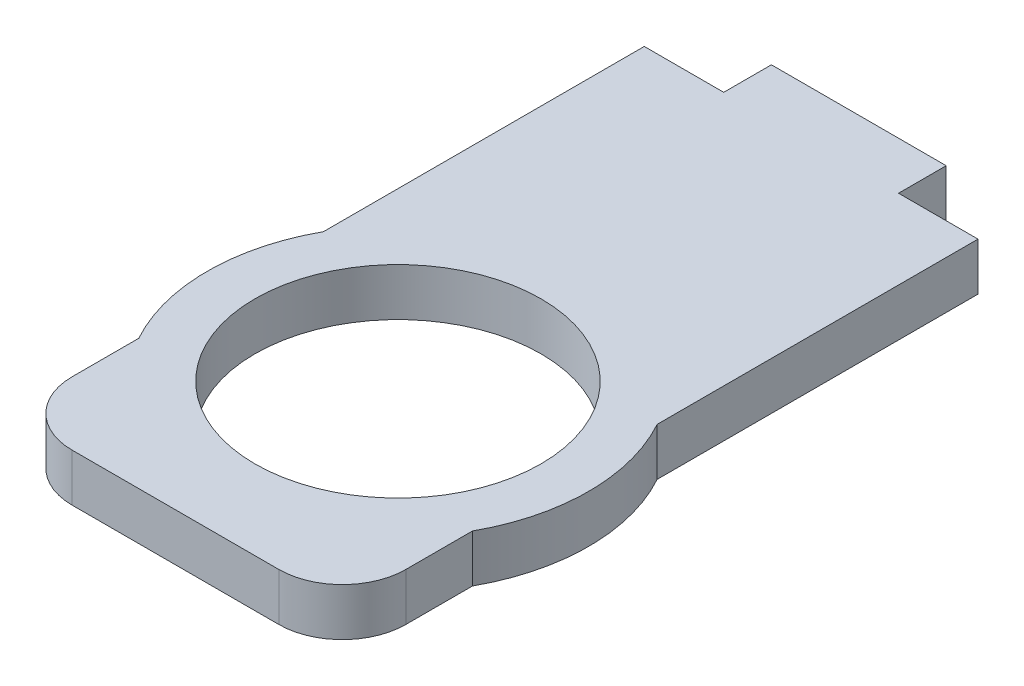
ISO-10303-21;
HEADER;
FILE_DESCRIPTION(('STEP AP214'),'2;1');
FILE_NAME('part.step','',(''),(''),'','','');
FILE_SCHEMA(('AUTOMOTIVE_DESIGN { 1 0 10303 214 1 1 1 1 }'));
ENDSEC;
DATA;
#1=APPLICATION_CONTEXT('core data for automotive mechanical design processes');
#2=APPLICATION_PROTOCOL_DEFINITION('international standard','automotive_design',2000,#1);
#3=PRODUCT_CONTEXT('',#1,'mechanical');
#4=PRODUCT('Part','Part','',(#3));
#5=PRODUCT_RELATED_PRODUCT_CATEGORY('part','',(#4));
#6=PRODUCT_DEFINITION_FORMATION('','',#4);
#7=PRODUCT_DEFINITION_CONTEXT('part definition',#1,'design');
#8=PRODUCT_DEFINITION('design','',#6,#7);
#9=PRODUCT_DEFINITION_SHAPE('','',#8);
#10=(LENGTH_UNIT() NAMED_UNIT(*) SI_UNIT(.MILLI.,.METRE.));
#11=(NAMED_UNIT(*) PLANE_ANGLE_UNIT() SI_UNIT($,.RADIAN.));
#12=(NAMED_UNIT(*) SI_UNIT($,.STERADIAN.) SOLID_ANGLE_UNIT());
#13=UNCERTAINTY_MEASURE_WITH_UNIT(LENGTH_MEASURE(1.E-05),#10,'distance_accuracy_value','');
#14=(GEOMETRIC_REPRESENTATION_CONTEXT(3) GLOBAL_UNCERTAINTY_ASSIGNED_CONTEXT((#13)) GLOBAL_UNIT_ASSIGNED_CONTEXT((#10,
#11,#12)) REPRESENTATION_CONTEXT('',''));
#15=CARTESIAN_POINT('',(0.,0.,0.));
#16=DIRECTION('',(0.,0.,1.));
#17=DIRECTION('',(1.,0.,0.));
#18=AXIS2_PLACEMENT_3D('',#15,#16,#17);
#19=CARTESIAN_POINT('',(-14.335128068385,46.2178627675772,61.2132034355965));
#20=DIRECTION('',(-1.,0.,0.));
#21=DIRECTION('',(0.,0.,1.));
#22=AXIS2_PLACEMENT_3D('',#19,#20,#21);
#23=PLANE('',#22);
#24=DIRECTION('',(0.,0.,-1.));
#25=VECTOR('',#24,1.);
#26=CARTESIAN_POINT('',(-14.335128068385,49.2178627675772,61.2132034355965));
#27=LINE('',#26,#25);
#28=CARTESIAN_POINT('',(-14.335128068385,49.2178627675772,20.1905249806889));
#29=VERTEX_POINT('',#28);
#30=CARTESIAN_POINT('',(-14.335128068385,49.2178627675772,0.));
#31=VERTEX_POINT('',#30);
#32=EDGE_CURVE('E190',#29,#31,#27,.T.);
#33=ORIENTED_EDGE('',*,*,#32,.F.);
#34=DIRECTION('',(0.,-1.,0.));
#35=VECTOR('',#34,1.);
#36=CARTESIAN_POINT('',(-14.335128068385,83.1589882644875,20.1905249806889));
#37=LINE('',#36,#35);
#38=CARTESIAN_POINT('',(-14.335128068385,46.2178627675332,20.1905249806889));
#39=VERTEX_POINT('',#38);
#40=EDGE_CURVE('E175',#29,#39,#37,.T.);
#41=ORIENTED_EDGE('',*,*,#40,.T.);
#42=DIRECTION('',(0.,0.,-1.));
#43=VECTOR('',#42,1.);
#44=CARTESIAN_POINT('',(-14.335128068385,46.2178627675772,61.2132034355965));
#45=LINE('',#44,#43);
#46=CARTESIAN_POINT('',(-14.335128068385,46.2178627675772,0.));
#47=VERTEX_POINT('',#46);
#48=EDGE_CURVE('E195',#39,#47,#45,.T.);
#49=ORIENTED_EDGE('',*,*,#48,.T.);
#50=DIRECTION('',(0.,1.,0.));
#51=VECTOR('',#50,1.);
#52=CARTESIAN_POINT('',(-14.335128068385,46.2178627675772,0.));
#53=LINE('',#52,#51);
#54=EDGE_CURVE('E187',#47,#31,#53,.T.);
#55=ORIENTED_EDGE('',*,*,#54,.T.);
#56=EDGE_LOOP('',(#33,#41,#49,#55));
#57=FACE_BOUND('',#56,.T.);
#58=ADVANCED_FACE('F38',(#57),#23,.F.);
#59=CARTESIAN_POINT('',(-35.335128068385,49.2178627675772,61.2132034355965));
#60=DIRECTION('',(1.,0.,0.));
#61=DIRECTION('',(0.,0.,-1.));
#62=AXIS2_PLACEMENT_3D('',#59,#60,#61);
#63=PLANE('',#62);
#64=DIRECTION('',(0.,0.,-1.));
#65=VECTOR('',#64,1.);
#66=CARTESIAN_POINT('',(-35.335128068385,46.2178627675772,61.2132034355965));
#67=LINE('',#66,#65);
#68=CARTESIAN_POINT('',(-35.335128068385,46.2178627675772,36.));
#69=VERTEX_POINT('',#68);
#70=CARTESIAN_POINT('',(-35.335128068385,46.2178627675772,31.8094750193111));
#71=VERTEX_POINT('',#70);
#72=EDGE_CURVE('E206',#69,#71,#67,.T.);
#73=ORIENTED_EDGE('',*,*,#72,.F.);
#74=DIRECTION('',(0.,-1.,0.));
#75=VECTOR('',#74,1.);
#76=CARTESIAN_POINT('',(-35.335128068385,49.2178627675772,36.));
#77=LINE('',#76,#75);
#78=CARTESIAN_POINT('',(-35.335128068385,49.2178627675772,36.));
#79=VERTEX_POINT('',#78);
#80=EDGE_CURVE('E61',#69,#79,#77,.F.);
#81=ORIENTED_EDGE('',*,*,#80,.T.);
#82=DIRECTION('',(0.,0.,-1.));
#83=VECTOR('',#82,1.);
#84=CARTESIAN_POINT('',(-35.335128068385,49.2178627675772,61.2132034355965));
#85=LINE('',#84,#83);
#86=CARTESIAN_POINT('',(-35.335128068385,49.2178627675772,31.8094750193111));
#87=VERTEX_POINT('',#86);
#88=EDGE_CURVE('E149',#79,#87,#85,.T.);
#89=ORIENTED_EDGE('',*,*,#88,.T.);
#90=DIRECTION('',(0.,-1.,0.));
#91=VECTOR('',#90,1.);
#92=CARTESIAN_POINT('',(-35.335128068385,83.1589882644875,31.8094750193111));
#93=LINE('',#92,#91);
#94=EDGE_CURVE('E159',#87,#71,#93,.T.);
#95=ORIENTED_EDGE('',*,*,#94,.T.);
#96=EDGE_LOOP('',(#73,#81,#89,#95));
#97=FACE_BOUND('',#96,.T.);
#98=ADVANCED_FACE('F253',(#97),#63,.F.);
#99=CARTESIAN_POINT('',(-30.3351280683851,46.2178627675332,-14.4017542509914));
#100=DIRECTION('',(0.,-1.,0.));
#101=DIRECTION('',(0.,0.,-1.));
#102=AXIS2_PLACEMENT_3D('',#99,#100,#101);
#103=PLANE('',#102);
#104=DIRECTION('',(1.,0.,0.));
#105=VECTOR('',#104,1.);
#106=CARTESIAN_POINT('',(-35.335128068385,46.2178627675772,40.));
#107=LINE('',#106,#105);
#108=CARTESIAN_POINT('',(-31.335128068385,46.2178627675772,40.));
#109=VERTEX_POINT('',#108);
#110=CARTESIAN_POINT('',(-18.335128068385,46.2178627675772,40.));
#111=VERTEX_POINT('',#110);
#112=EDGE_CURVE('E184',#109,#111,#107,.T.);
#113=ORIENTED_EDGE('',*,*,#112,.F.);
#114=CARTESIAN_POINT('',(-31.335128068385,46.2178627675332,36.));
#115=DIRECTION('',(0.,-1.,0.));
#116=DIRECTION('',(0.,0.,-1.));
#117=AXIS2_PLACEMENT_3D('',#114,#115,#116);
#118=CIRCLE('',#117,4.);
#119=EDGE_CURVE('E239',#109,#69,#118,.T.);
#120=ORIENTED_EDGE('',*,*,#119,.T.);
#121=ORIENTED_EDGE('',*,*,#72,.T.);
#122=CARTESIAN_POINT('',(-24.835128068385,46.2178627675332,26.));
#123=DIRECTION('',(0.,-1.,0.));
#124=DIRECTION('',(0.,0.,-1.));
#125=AXIS2_PLACEMENT_3D('',#122,#123,#124);
#126=CIRCLE('',#125,12.);
#127=CARTESIAN_POINT('',(-35.335128068385,46.2178627675772,20.1905249806889));
#128=VERTEX_POINT('',#127);
#129=EDGE_CURVE('E165',#71,#128,#126,.T.);
#130=ORIENTED_EDGE('',*,*,#129,.T.);
#131=CARTESIAN_POINT('',(-35.335128068385,46.2178627675772,0.));
#132=VERTEX_POINT('',#131);
#133=EDGE_CURVE('E155',#128,#132,#67,.T.);
#134=ORIENTED_EDGE('',*,*,#133,.T.);
#135=DIRECTION('',(1.,0.,0.));
#136=VECTOR('',#135,1.);
#137=CARTESIAN_POINT('',(-35.335128068385,46.2178627675772,0.));
#138=LINE('',#137,#136);
#139=CARTESIAN_POINT('',(-30.3351280683851,46.2178627675772,0.));
#140=VERTEX_POINT('',#139);
#141=EDGE_CURVE('E192',#132,#140,#138,.T.);
#142=ORIENTED_EDGE('',*,*,#141,.T.);
#143=DIRECTION('',(0.,0.,1.));
#144=VECTOR('',#143,1.);
#145=CARTESIAN_POINT('',(-30.3351280683851,46.2178627675332,-14.4017542509914));
#146=LINE('',#145,#144);
#147=CARTESIAN_POINT('',(-30.3351280683851,46.2178627675332,-3.00000000000001));
#148=VERTEX_POINT('',#147);
#149=EDGE_CURVE('E211',#148,#140,#146,.T.);
#150=ORIENTED_EDGE('',*,*,#149,.F.);
#151=DIRECTION('',(-1.,0.,0.));
#152=VECTOR('',#151,1.);
#153=CARTESIAN_POINT('',(-30.3351280683851,46.2178627675332,-3.00000000000001));
#154=LINE('',#153,#152);
#155=CARTESIAN_POINT('',(-19.3351280683851,46.2178627675332,-3.00000000000001));
#156=VERTEX_POINT('',#155);
#157=EDGE_CURVE('E213',#156,#148,#154,.T.);
#158=ORIENTED_EDGE('',*,*,#157,.F.);
#159=DIRECTION('',(0.,0.,1.));
#160=VECTOR('',#159,1.);
#161=CARTESIAN_POINT('',(-19.3351280683851,46.2178627675332,-14.4017542509914));
#162=LINE('',#161,#160);
#163=CARTESIAN_POINT('',(-19.3351280683851,46.2178627675332,0.));
#164=VERTEX_POINT('',#163);
#165=EDGE_CURVE('E220',#156,#164,#162,.T.);
#166=ORIENTED_EDGE('',*,*,#165,.T.);
#167=EDGE_CURVE('E196',#164,#47,#138,.T.);
#168=ORIENTED_EDGE('',*,*,#167,.T.);
#169=ORIENTED_EDGE('',*,*,#48,.F.);
#170=CARTESIAN_POINT('',(-14.335128068385,46.2178627675332,31.8094750193111));
#171=VERTEX_POINT('',#170);
#172=EDGE_CURVE('E168',#39,#171,#126,.T.);
#173=ORIENTED_EDGE('',*,*,#172,.T.);
#174=CARTESIAN_POINT('',(-14.335128068385,46.2178627675772,36.));
#175=VERTEX_POINT('',#174);
#176=EDGE_CURVE('E191',#175,#171,#45,.T.);
#177=ORIENTED_EDGE('',*,*,#176,.F.);
#178=CARTESIAN_POINT('',(-18.335128068385,46.2178627675332,36.));
#179=DIRECTION('',(0.,-1.,0.));
#180=DIRECTION('',(0.,0.,-1.));
#181=AXIS2_PLACEMENT_3D('',#178,#179,#180);
#182=CIRCLE('',#181,4.);
#183=EDGE_CURVE('E237',#175,#111,#182,.T.);
#184=ORIENTED_EDGE('',*,*,#183,.T.);
#185=EDGE_LOOP('',(#113,#120,#121,#130,#134,#142,#150,#158,#166,#168,#169,#173,#177,#184));
#186=FACE_BOUND('',#185,.T.);
#187=CARTESIAN_POINT('',(-24.835128068385,46.2178627675332,26.));
#188=DIRECTION('',(0.,-1.,0.));
#189=DIRECTION('',(0.,0.,-1.));
#190=AXIS2_PLACEMENT_3D('',#187,#188,#189);
#191=CIRCLE('',#190,9.);
#192=CARTESIAN_POINT('',(-24.835128068385,46.2178627675332,17.));
#193=VERTEX_POINT('',#192);
#194=EDGE_CURVE('E178',#193,#193,#191,.T.);
#195=ORIENTED_EDGE('',*,*,#194,.F.);
#196=EDGE_LOOP('',(#195));
#197=FACE_BOUND('',#196,.T.);
#198=ADVANCED_FACE('F251',(#186,#197),#103,.T.);
#199=CARTESIAN_POINT('',(-30.3351280683851,49.2178627675332,-14.4017542509914));
#200=DIRECTION('',(-1.,0.,0.));
#201=DIRECTION('',(0.,0.,1.));
#202=AXIS2_PLACEMENT_3D('',#199,#200,#201);
#203=PLANE('',#202);
#204=DIRECTION('',(0.,1.,0.));
#205=VECTOR('',#204,1.);
#206=CARTESIAN_POINT('',(-30.3351280683851,49.2178627675332,-3.00000000000001));
#207=LINE('',#206,#205);
#208=CARTESIAN_POINT('',(-30.3351280683851,49.2178627675332,-3.00000000000001));
#209=VERTEX_POINT('',#208);
#210=EDGE_CURVE('E210',#148,#209,#207,.T.);
#211=ORIENTED_EDGE('',*,*,#210,.F.);
#212=ORIENTED_EDGE('',*,*,#149,.T.);
#213=DIRECTION('',(0.,-1.,0.));
#214=VECTOR('',#213,1.);
#215=CARTESIAN_POINT('',(-30.3351280683851,49.2178627675332,0.));
#216=LINE('',#215,#214);
#217=CARTESIAN_POINT('',(-30.3351280683851,49.2178627675332,0.));
#218=VERTEX_POINT('',#217);
#219=EDGE_CURVE('E217',#218,#140,#216,.T.);
#220=ORIENTED_EDGE('',*,*,#219,.F.);
#221=DIRECTION('',(0.,0.,1.));
#222=VECTOR('',#221,1.);
#223=CARTESIAN_POINT('',(-30.3351280683851,49.2178627675332,-14.4017542509914));
#224=LINE('',#223,#222);
#225=EDGE_CURVE('E222',#209,#218,#224,.T.);
#226=ORIENTED_EDGE('',*,*,#225,.F.);
#227=EDGE_LOOP('',(#211,#212,#220,#226));
#228=FACE_BOUND('',#227,.T.);
#229=ADVANCED_FACE('F262',(#228),#203,.T.);
#230=CARTESIAN_POINT('',(-19.3351280683851,49.2178627675332,-14.4017542509914));
#231=DIRECTION('',(0.,1.,0.));
#232=DIRECTION('',(0.,0.,1.));
#233=AXIS2_PLACEMENT_3D('',#230,#231,#232);
#234=PLANE('',#233);
#235=ORIENTED_EDGE('',*,*,#88,.F.);
#236=CARTESIAN_POINT('',(-31.335128068385,49.2178627675332,36.));
#237=DIRECTION('',(0.,1.,0.));
#238=DIRECTION('',(0.,0.,1.));
#239=AXIS2_PLACEMENT_3D('',#236,#237,#238);
#240=CIRCLE('',#239,4.);
#241=CARTESIAN_POINT('',(-31.335128068385,49.2178627675772,40.));
#242=VERTEX_POINT('',#241);
#243=EDGE_CURVE('E46',#79,#242,#240,.T.);
#244=ORIENTED_EDGE('',*,*,#243,.T.);
#245=DIRECTION('',(-1.,0.,0.));
#246=VECTOR('',#245,1.);
#247=CARTESIAN_POINT('',(-14.335128068385,49.2178627675772,40.));
#248=LINE('',#247,#246);
#249=CARTESIAN_POINT('',(-18.335128068385,49.2178627675772,40.));
#250=VERTEX_POINT('',#249);
#251=EDGE_CURVE('E197',#250,#242,#248,.T.);
#252=ORIENTED_EDGE('',*,*,#251,.F.);
#253=CARTESIAN_POINT('',(-18.335128068385,49.2178627675332,36.));
#254=DIRECTION('',(0.,1.,0.));
#255=DIRECTION('',(0.,0.,1.));
#256=AXIS2_PLACEMENT_3D('',#253,#254,#255);
#257=CIRCLE('',#256,4.);
#258=CARTESIAN_POINT('',(-14.335128068385,49.2178627675772,36.));
#259=VERTEX_POINT('',#258);
#260=EDGE_CURVE('E53',#250,#259,#257,.T.);
#261=ORIENTED_EDGE('',*,*,#260,.T.);
#262=CARTESIAN_POINT('',(-14.335128068385,49.2178627675332,31.8094750193111));
#263=VERTEX_POINT('',#262);
#264=EDGE_CURVE('E204',#259,#263,#27,.T.);
#265=ORIENTED_EDGE('',*,*,#264,.T.);
#266=CARTESIAN_POINT('',(-24.835128068385,49.2178627675332,26.));
#267=DIRECTION('',(0.,1.,0.));
#268=DIRECTION('',(0.,0.,1.));
#269=AXIS2_PLACEMENT_3D('',#266,#267,#268);
#270=CIRCLE('',#269,12.);
#271=EDGE_CURVE('E166',#29,#263,#270,.F.);
#272=ORIENTED_EDGE('',*,*,#271,.F.);
#273=ORIENTED_EDGE('',*,*,#32,.T.);
#274=DIRECTION('',(-1.,0.,0.));
#275=VECTOR('',#274,1.);
#276=CARTESIAN_POINT('',(-14.335128068385,49.2178627675772,0.));
#277=LINE('',#276,#275);
#278=CARTESIAN_POINT('',(-19.3351280683851,49.2178627675332,0.));
#279=VERTEX_POINT('',#278);
#280=EDGE_CURVE('E150',#31,#279,#277,.T.);
#281=ORIENTED_EDGE('',*,*,#280,.T.);
#282=DIRECTION('',(0.,0.,1.));
#283=VECTOR('',#282,1.);
#284=CARTESIAN_POINT('',(-19.3351280683851,49.2178627675332,-14.4017542509914));
#285=LINE('',#284,#283);
#286=CARTESIAN_POINT('',(-19.3351280683851,49.2178627675332,-3.00000000000001));
#287=VERTEX_POINT('',#286);
#288=EDGE_CURVE('E224',#287,#279,#285,.T.);
#289=ORIENTED_EDGE('',*,*,#288,.F.);
#290=DIRECTION('',(1.,0.,0.));
#291=VECTOR('',#290,1.);
#292=CARTESIAN_POINT('',(-19.3351280683851,49.2178627675332,-3.00000000000001));
#293=LINE('',#292,#291);
#294=EDGE_CURVE('E208',#209,#287,#293,.T.);
#295=ORIENTED_EDGE('',*,*,#294,.F.);
#296=ORIENTED_EDGE('',*,*,#225,.T.);
#297=CARTESIAN_POINT('',(-35.335128068385,49.2178627675772,0.));
#298=VERTEX_POINT('',#297);
#299=EDGE_CURVE('E145',#218,#298,#277,.T.);
#300=ORIENTED_EDGE('',*,*,#299,.T.);
#301=CARTESIAN_POINT('',(-35.335128068385,49.2178627675332,20.1905249806889));
#302=VERTEX_POINT('',#301);
#303=EDGE_CURVE('E138',#302,#298,#85,.T.);
#304=ORIENTED_EDGE('',*,*,#303,.F.);
#305=EDGE_CURVE('E143',#87,#302,#270,.F.);
#306=ORIENTED_EDGE('',*,*,#305,.F.);
#307=EDGE_LOOP('',(#235,#244,#252,#261,#265,#272,#273,#281,#289,#295,#296,#300,#304,#306));
#308=FACE_BOUND('',#307,.T.);
#309=CARTESIAN_POINT('',(-24.835128068385,49.2178627675332,26.));
#310=DIRECTION('',(0.,1.,0.));
#311=DIRECTION('',(0.,0.,1.));
#312=AXIS2_PLACEMENT_3D('',#309,#310,#311);
#313=CIRCLE('',#312,9.);
#314=CARTESIAN_POINT('',(-24.835128068385,49.2178627675332,35.));
#315=VERTEX_POINT('',#314);
#316=EDGE_CURVE('E181',#315,#315,#313,.T.);
#317=ORIENTED_EDGE('',*,*,#316,.F.);
#318=EDGE_LOOP('',(#317));
#319=FACE_BOUND('',#318,.T.);
#320=ADVANCED_FACE('F140',(#308,#319),#234,.T.);
#321=CARTESIAN_POINT('',(-19.3351280683851,46.2178627675332,-14.4017542509914));
#322=DIRECTION('',(1.,0.,0.));
#323=DIRECTION('',(0.,0.,-1.));
#324=AXIS2_PLACEMENT_3D('',#321,#322,#323);
#325=PLANE('',#324);
#326=DIRECTION('',(0.,-1.,0.));
#327=VECTOR('',#326,1.);
#328=CARTESIAN_POINT('',(-19.3351280683851,46.2178627675332,-3.00000000000001));
#329=LINE('',#328,#327);
#330=EDGE_CURVE('E160',#287,#156,#329,.T.);
#331=ORIENTED_EDGE('',*,*,#330,.F.);
#332=ORIENTED_EDGE('',*,*,#288,.T.);
#333=DIRECTION('',(0.,1.,0.));
#334=VECTOR('',#333,1.);
#335=CARTESIAN_POINT('',(-19.3351280683851,46.2178627675332,0.));
#336=LINE('',#335,#334);
#337=EDGE_CURVE('E200',#164,#279,#336,.T.);
#338=ORIENTED_EDGE('',*,*,#337,.F.);
#339=ORIENTED_EDGE('',*,*,#165,.F.);
#340=EDGE_LOOP('',(#331,#332,#338,#339));
#341=FACE_BOUND('',#340,.T.);
#342=ADVANCED_FACE('F270',(#341),#325,.T.);
#343=CARTESIAN_POINT('',(21.7493954765021,20.8169300817554,-3.00000000000001));
#344=DIRECTION('',(0.,0.,1.));
#345=DIRECTION('',(0.843391445808129,0.53729960835429,0.));
#346=AXIS2_PLACEMENT_3D('',#343,#344,#345);
#347=PLANE('',#346);
#348=ORIENTED_EDGE('',*,*,#157,.T.);
#349=ORIENTED_EDGE('',*,*,#210,.T.);
#350=ORIENTED_EDGE('',*,*,#294,.T.);
#351=ORIENTED_EDGE('',*,*,#330,.T.);
#352=EDGE_LOOP('',(#348,#349,#350,#351));
#353=FACE_BOUND('',#352,.T.);
#354=ADVANCED_FACE('F311',(#353),#347,.F.);
#355=CARTESIAN_POINT('',(0.,0.,0.));
#356=DIRECTION('',(0.,0.,1.));
#357=DIRECTION('',(1.,0.,0.));
#358=AXIS2_PLACEMENT_3D('',#355,#356,#357);
#359=PLANE('',#358);
#360=ORIENTED_EDGE('',*,*,#167,.F.);
#361=ORIENTED_EDGE('',*,*,#337,.T.);
#362=ORIENTED_EDGE('',*,*,#280,.F.);
#363=ORIENTED_EDGE('',*,*,#54,.F.);
#364=EDGE_LOOP('',(#360,#361,#362,#363));
#365=FACE_BOUND('',#364,.T.);
#366=ADVANCED_FACE('F276',(#365),#359,.F.);
#367=ORIENTED_EDGE('',*,*,#299,.F.);
#368=ORIENTED_EDGE('',*,*,#219,.T.);
#369=ORIENTED_EDGE('',*,*,#141,.F.);
#370=DIRECTION('',(0.,-1.,0.));
#371=VECTOR('',#370,1.);
#372=CARTESIAN_POINT('',(-35.335128068385,49.2178627675772,0.));
#373=LINE('',#372,#371);
#374=EDGE_CURVE('E182',#298,#132,#373,.T.);
#375=ORIENTED_EDGE('',*,*,#374,.F.);
#376=EDGE_LOOP('',(#367,#368,#369,#375));
#377=FACE_BOUND('',#376,.T.);
#378=ADVANCED_FACE('F257',(#377),#359,.F.);
#379=ORIENTED_EDGE('',*,*,#264,.F.);
#380=DIRECTION('',(0.,1.,0.));
#381=VECTOR('',#380,1.);
#382=CARTESIAN_POINT('',(-14.335128068385,46.2178627675772,36.));
#383=LINE('',#382,#381);
#384=EDGE_CURVE('E11',#259,#175,#383,.F.);
#385=ORIENTED_EDGE('',*,*,#384,.T.);
#386=ORIENTED_EDGE('',*,*,#176,.T.);
#387=DIRECTION('',(0.,-1.,0.));
#388=VECTOR('',#387,1.);
#389=CARTESIAN_POINT('',(-14.335128068385,83.1589882644875,31.8094750193111));
#390=LINE('',#389,#388);
#391=EDGE_CURVE('E172',#171,#263,#390,.F.);
#392=ORIENTED_EDGE('',*,*,#391,.T.);
#393=EDGE_LOOP('',(#379,#385,#386,#392));
#394=FACE_BOUND('',#393,.T.);
#395=ADVANCED_FACE('F287',(#394),#23,.F.);
#396=ORIENTED_EDGE('',*,*,#133,.F.);
#397=DIRECTION('',(0.,-1.,0.));
#398=VECTOR('',#397,1.);
#399=CARTESIAN_POINT('',(-35.335128068385,83.1589882644875,20.1905249806889));
#400=LINE('',#399,#398);
#401=EDGE_CURVE('E153',#128,#302,#400,.F.);
#402=ORIENTED_EDGE('',*,*,#401,.T.);
#403=ORIENTED_EDGE('',*,*,#303,.T.);
#404=ORIENTED_EDGE('',*,*,#374,.T.);
#405=EDGE_LOOP('',(#396,#402,#403,#404));
#406=FACE_BOUND('',#405,.T.);
#407=ADVANCED_FACE('F154',(#406),#63,.F.);
#408=CARTESIAN_POINT('',(21.7493954765021,20.8169300817554,40.));
#409=DIRECTION('',(0.,0.,1.));
#410=DIRECTION('',(0.843391445808129,0.53729960835429,0.));
#411=AXIS2_PLACEMENT_3D('',#408,#409,#410);
#412=PLANE('',#411);
#413=ORIENTED_EDGE('',*,*,#251,.T.);
#414=DIRECTION('',(0.,-1.,0.));
#415=VECTOR('',#414,1.);
#416=CARTESIAN_POINT('',(-31.335128068385,46.2178627675772,40.));
#417=LINE('',#416,#415);
#418=EDGE_CURVE('E234',#242,#109,#417,.T.);
#419=ORIENTED_EDGE('',*,*,#418,.T.);
#420=ORIENTED_EDGE('',*,*,#112,.T.);
#421=DIRECTION('',(0.,1.,0.));
#422=VECTOR('',#421,1.);
#423=CARTESIAN_POINT('',(-18.335128068385,49.2178627675772,40.));
#424=LINE('',#423,#422);
#425=EDGE_CURVE('E231',#111,#250,#424,.T.);
#426=ORIENTED_EDGE('',*,*,#425,.T.);
#427=EDGE_LOOP('',(#413,#419,#420,#426));
#428=FACE_BOUND('',#427,.T.);
#429=ADVANCED_FACE('F246',(#428),#412,.T.);
#430=CARTESIAN_POINT('',(-24.835128068385,56.2178627675332,26.));
#431=DIRECTION('',(0.,-1.,0.));
#432=DIRECTION('',(0.,0.,-1.));
#433=AXIS2_PLACEMENT_3D('',#430,#431,#432);
#434=CYLINDRICAL_SURFACE('',#433,9.);
#435=ORIENTED_EDGE('',*,*,#316,.T.);
#436=EDGE_LOOP('',(#435));
#437=FACE_BOUND('',#436,.T.);
#438=ORIENTED_EDGE('',*,*,#194,.T.);
#439=EDGE_LOOP('',(#438));
#440=FACE_BOUND('',#439,.T.);
#441=ADVANCED_FACE('F313',(#437,#440),#434,.F.);
#442=CARTESIAN_POINT('',(-24.835128068385,83.1589882644875,26.));
#443=DIRECTION('',(0.,-1.,0.));
#444=DIRECTION('',(0.,0.,-1.));
#445=AXIS2_PLACEMENT_3D('',#442,#443,#444);
#446=CYLINDRICAL_SURFACE('',#445,12.);
#447=ORIENTED_EDGE('',*,*,#94,.F.);
#448=ORIENTED_EDGE('',*,*,#305,.T.);
#449=ORIENTED_EDGE('',*,*,#401,.F.);
#450=ORIENTED_EDGE('',*,*,#129,.F.);
#451=EDGE_LOOP('',(#447,#448,#449,#450));
#452=FACE_BOUND('',#451,.T.);
#453=ADVANCED_FACE('F163',(#452),#446,.T.);
#454=ORIENTED_EDGE('',*,*,#40,.F.);
#455=ORIENTED_EDGE('',*,*,#271,.T.);
#456=ORIENTED_EDGE('',*,*,#391,.F.);
#457=ORIENTED_EDGE('',*,*,#172,.F.);
#458=EDGE_LOOP('',(#454,#455,#456,#457));
#459=FACE_BOUND('',#458,.T.);
#460=ADVANCED_FACE('F284',(#459),#446,.T.);
#461=CARTESIAN_POINT('',(-31.335128068385,20.8169300817554,36.));
#462=DIRECTION('',(0.,1.,0.));
#463=DIRECTION('',(0.,0.,1.));
#464=AXIS2_PLACEMENT_3D('',#461,#462,#463);
#465=CYLINDRICAL_SURFACE('',#464,4.);
#466=ORIENTED_EDGE('',*,*,#243,.F.);
#467=ORIENTED_EDGE('',*,*,#80,.F.);
#468=ORIENTED_EDGE('',*,*,#119,.F.);
#469=ORIENTED_EDGE('',*,*,#418,.F.);
#470=EDGE_LOOP('',(#466,#467,#468,#469));
#471=FACE_BOUND('',#470,.T.);
#472=ADVANCED_FACE('F249',(#471),#465,.T.);
#473=CARTESIAN_POINT('',(-18.335128068385,20.8169300817554,36.));
#474=DIRECTION('',(0.,-1.,0.));
#475=DIRECTION('',(0.,0.,-1.));
#476=AXIS2_PLACEMENT_3D('',#473,#474,#475);
#477=CYLINDRICAL_SURFACE('',#476,4.);
#478=ORIENTED_EDGE('',*,*,#183,.F.);
#479=ORIENTED_EDGE('',*,*,#384,.F.);
#480=ORIENTED_EDGE('',*,*,#260,.F.);
#481=ORIENTED_EDGE('',*,*,#425,.F.);
#482=EDGE_LOOP('',(#478,#479,#480,#481));
#483=FACE_BOUND('',#482,.T.);
#484=ADVANCED_FACE('F40',(#483),#477,.T.);
#485=CLOSED_SHELL('',(#58,#98,#198,#229,#320,#342,#354,#366,#378,#395,#407,#429,#441,#453,#460,
#472,#484));
#486=MANIFOLD_SOLID_BREP('B2',#485);
#487=ADVANCED_BREP_SHAPE_REPRESENTATION('',(#18,#486),#14);
#488=SHAPE_DEFINITION_REPRESENTATION(#9,#487);
ENDSEC;
END-ISO-10303-21;
